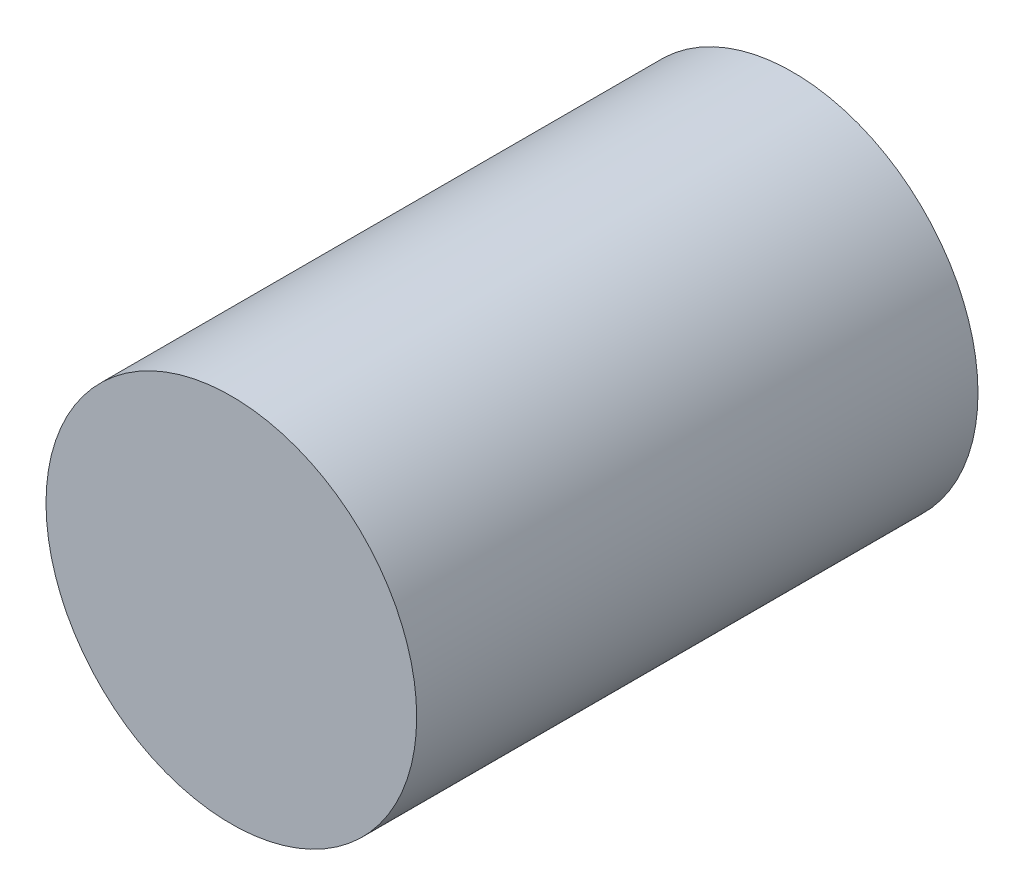
ISO-10303-21;
HEADER;
FILE_DESCRIPTION(('STEP AP214'),'2;1');
FILE_NAME('part.step','',(''),(''),'','','');
FILE_SCHEMA(('AUTOMOTIVE_DESIGN { 1 0 10303 214 1 1 1 1 }'));
ENDSEC;
DATA;
#1=APPLICATION_CONTEXT('core data for automotive mechanical design processes');
#2=APPLICATION_PROTOCOL_DEFINITION('international standard','automotive_design',2000,#1);
#3=PRODUCT_CONTEXT('',#1,'mechanical');
#4=PRODUCT('Part','Part','',(#3));
#5=PRODUCT_RELATED_PRODUCT_CATEGORY('part','',(#4));
#6=PRODUCT_DEFINITION_FORMATION('','',#4);
#7=PRODUCT_DEFINITION_CONTEXT('part definition',#1,'design');
#8=PRODUCT_DEFINITION('design','',#6,#7);
#9=PRODUCT_DEFINITION_SHAPE('','',#8);
#10=(LENGTH_UNIT() NAMED_UNIT(*) SI_UNIT(.MILLI.,.METRE.));
#11=(NAMED_UNIT(*) PLANE_ANGLE_UNIT() SI_UNIT($,.RADIAN.));
#12=(NAMED_UNIT(*) SI_UNIT($,.STERADIAN.) SOLID_ANGLE_UNIT());
#13=UNCERTAINTY_MEASURE_WITH_UNIT(LENGTH_MEASURE(1.E-05),#10,'distance_accuracy_value','');
#14=(GEOMETRIC_REPRESENTATION_CONTEXT(3) GLOBAL_UNCERTAINTY_ASSIGNED_CONTEXT((#13)) GLOBAL_UNIT_ASSIGNED_CONTEXT((#10,
#11,#12)) REPRESENTATION_CONTEXT('',''));
#15=CARTESIAN_POINT('',(0.,0.,0.));
#16=DIRECTION('',(0.,0.,1.));
#17=DIRECTION('',(1.,0.,0.));
#18=AXIS2_PLACEMENT_3D('',#15,#16,#17);
#19=CARTESIAN_POINT('',(0.,0.,132.5));
#20=DIRECTION('',(0.,0.,-1.));
#21=DIRECTION('',(-1.,0.,0.));
#22=AXIS2_PLACEMENT_3D('',#19,#20,#21);
#23=CYLINDRICAL_SURFACE('',#22,87.5);
#24=CARTESIAN_POINT('',(0.,0.,132.5));
#25=DIRECTION('',(0.,0.,1.));
#26=DIRECTION('',(1.,0.,0.));
#27=AXIS2_PLACEMENT_3D('',#24,#25,#26);
#28=CIRCLE('',#27,87.5);
#29=CARTESIAN_POINT('',(87.5,0.,132.5));
#30=VERTEX_POINT('',#29);
#31=EDGE_CURVE('E10',#30,#30,#28,.T.);
#32=ORIENTED_EDGE('',*,*,#31,.F.);
#33=EDGE_LOOP('',(#32));
#34=FACE_BOUND('',#33,.T.);
#35=CARTESIAN_POINT('',(0.,0.,-132.5));
#36=DIRECTION('',(0.,0.,1.));
#37=DIRECTION('',(1.,0.,0.));
#38=AXIS2_PLACEMENT_3D('',#35,#36,#37);
#39=CIRCLE('',#38,87.5);
#40=CARTESIAN_POINT('',(87.5,0.,-132.5));
#41=VERTEX_POINT('',#40);
#42=EDGE_CURVE('E47',#41,#41,#39,.T.);
#43=ORIENTED_EDGE('',*,*,#42,.T.);
#44=EDGE_LOOP('',(#43));
#45=FACE_BOUND('',#44,.T.);
#46=ADVANCED_FACE('F40',(#34,#45),#23,.T.);
#47=CARTESIAN_POINT('',(0.,0.,132.5));
#48=DIRECTION('',(0.,0.,1.));
#49=DIRECTION('',(1.,0.,0.));
#50=AXIS2_PLACEMENT_3D('',#47,#48,#49);
#51=PLANE('',#50);
#52=ORIENTED_EDGE('',*,*,#31,.T.);
#53=EDGE_LOOP('',(#52));
#54=FACE_BOUND('',#53,.T.);
#55=ADVANCED_FACE('F57',(#54),#51,.T.);
#56=CARTESIAN_POINT('',(0.,0.,-132.5));
#57=DIRECTION('',(0.,0.,1.));
#58=DIRECTION('',(1.,0.,0.));
#59=AXIS2_PLACEMENT_3D('',#56,#57,#58);
#60=PLANE('',#59);
#61=ORIENTED_EDGE('',*,*,#42,.F.);
#62=EDGE_LOOP('',(#61));
#63=FACE_BOUND('',#62,.T.);
#64=ADVANCED_FACE('F55',(#63),#60,.F.);
#65=CLOSED_SHELL('',(#46,#55,#64));
#66=MANIFOLD_SOLID_BREP('B2',#65);
#67=ADVANCED_BREP_SHAPE_REPRESENTATION('',(#18,#66),#14);
#68=SHAPE_DEFINITION_REPRESENTATION(#9,#67);
ENDSEC;
END-ISO-10303-21;
